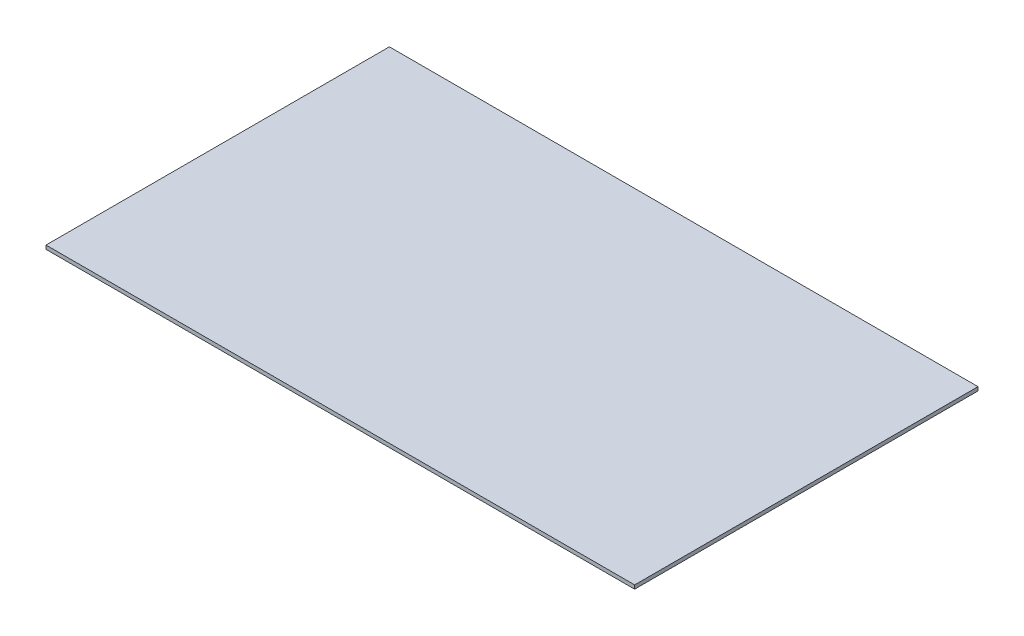
ISO-10303-21;
HEADER;
FILE_DESCRIPTION(('STEP AP214'),'2;1');
FILE_NAME('part.step','',(''),(''),'','','');
FILE_SCHEMA(('AUTOMOTIVE_DESIGN { 1 0 10303 214 1 1 1 1 }'));
ENDSEC;
DATA;
#1=APPLICATION_CONTEXT('core data for automotive mechanical design processes');
#2=APPLICATION_PROTOCOL_DEFINITION('international standard','automotive_design',2000,#1);
#3=PRODUCT_CONTEXT('',#1,'mechanical');
#4=PRODUCT('Part','Part','',(#3));
#5=PRODUCT_RELATED_PRODUCT_CATEGORY('part','',(#4));
#6=PRODUCT_DEFINITION_FORMATION('','',#4);
#7=PRODUCT_DEFINITION_CONTEXT('part definition',#1,'design');
#8=PRODUCT_DEFINITION('design','',#6,#7);
#9=PRODUCT_DEFINITION_SHAPE('','',#8);
#10=(LENGTH_UNIT() NAMED_UNIT(*) SI_UNIT(.MILLI.,.METRE.));
#11=(NAMED_UNIT(*) PLANE_ANGLE_UNIT() SI_UNIT($,.RADIAN.));
#12=(NAMED_UNIT(*) SI_UNIT($,.STERADIAN.) SOLID_ANGLE_UNIT());
#13=UNCERTAINTY_MEASURE_WITH_UNIT(LENGTH_MEASURE(1.E-05),#10,'distance_accuracy_value','');
#14=(GEOMETRIC_REPRESENTATION_CONTEXT(3) GLOBAL_UNCERTAINTY_ASSIGNED_CONTEXT((#13)) GLOBAL_UNIT_ASSIGNED_CONTEXT((#10,
#11,#12)) REPRESENTATION_CONTEXT('',''));
#15=CARTESIAN_POINT('',(0.,0.,0.));
#16=DIRECTION('',(0.,0.,1.));
#17=DIRECTION('',(1.,0.,0.));
#18=AXIS2_PLACEMENT_3D('',#15,#16,#17);
#19=CARTESIAN_POINT('',(0.,0.381,0.));
#20=DIRECTION('',(1.,0.,0.));
#21=DIRECTION('',(0.,0.,-1.));
#22=AXIS2_PLACEMENT_3D('',#19,#20,#21);
#23=PLANE('',#22);
#24=DIRECTION('',(0.,0.,1.));
#25=VECTOR('',#24,1.);
#26=CARTESIAN_POINT('',(0.,0.,0.));
#27=LINE('',#26,#25);
#28=CARTESIAN_POINT('',(0.,0.,-35.));
#29=VERTEX_POINT('',#28);
#30=CARTESIAN_POINT('',(0.,0.,0.));
#31=VERTEX_POINT('',#30);
#32=EDGE_CURVE('E111',#29,#31,#27,.T.);
#33=ORIENTED_EDGE('',*,*,#32,.T.);
#34=DIRECTION('',(0.,-1.,0.));
#35=VECTOR('',#34,1.);
#36=CARTESIAN_POINT('',(0.,0.381,0.));
#37=LINE('',#36,#35);
#38=CARTESIAN_POINT('',(0.,0.381,0.));
#39=VERTEX_POINT('',#38);
#40=EDGE_CURVE('E11',#39,#31,#37,.T.);
#41=ORIENTED_EDGE('',*,*,#40,.F.);
#42=DIRECTION('',(0.,0.,1.));
#43=VECTOR('',#42,1.);
#44=CARTESIAN_POINT('',(0.,0.381,0.));
#45=LINE('',#44,#43);
#46=CARTESIAN_POINT('',(0.,0.381,-35.));
#47=VERTEX_POINT('',#46);
#48=EDGE_CURVE('E95',#47,#39,#45,.T.);
#49=ORIENTED_EDGE('',*,*,#48,.F.);
#50=DIRECTION('',(0.,-1.,0.));
#51=VECTOR('',#50,1.);
#52=CARTESIAN_POINT('',(0.,0.381,-35.));
#53=LINE('',#52,#51);
#54=EDGE_CURVE('E107',#47,#29,#53,.T.);
#55=ORIENTED_EDGE('',*,*,#54,.T.);
#56=EDGE_LOOP('',(#33,#41,#49,#55));
#57=FACE_BOUND('',#56,.T.);
#58=ADVANCED_FACE('F43',(#57),#23,.F.);
#59=CARTESIAN_POINT('',(0.,0.381,0.));
#60=DIRECTION('',(0.,0.,-1.));
#61=DIRECTION('',(-1.,0.,0.));
#62=AXIS2_PLACEMENT_3D('',#59,#60,#61);
#63=PLANE('',#62);
#64=DIRECTION('',(1.,0.,0.));
#65=VECTOR('',#64,1.);
#66=CARTESIAN_POINT('',(0.,0.,0.));
#67=LINE('',#66,#65);
#68=CARTESIAN_POINT('',(60.,0.,0.));
#69=VERTEX_POINT('',#68);
#70=EDGE_CURVE('E100',#31,#69,#67,.T.);
#71=ORIENTED_EDGE('',*,*,#70,.T.);
#72=DIRECTION('',(0.,-1.,0.));
#73=VECTOR('',#72,1.);
#74=CARTESIAN_POINT('',(60.,0.381,0.));
#75=LINE('',#74,#73);
#76=CARTESIAN_POINT('',(60.,0.381,0.));
#77=VERTEX_POINT('',#76);
#78=EDGE_CURVE('E52',#77,#69,#75,.T.);
#79=ORIENTED_EDGE('',*,*,#78,.F.);
#80=DIRECTION('',(1.,0.,0.));
#81=VECTOR('',#80,1.);
#82=CARTESIAN_POINT('',(0.,0.381,0.));
#83=LINE('',#82,#81);
#84=EDGE_CURVE('E90',#39,#77,#83,.T.);
#85=ORIENTED_EDGE('',*,*,#84,.F.);
#86=ORIENTED_EDGE('',*,*,#40,.T.);
#87=EDGE_LOOP('',(#71,#79,#85,#86));
#88=FACE_BOUND('',#87,.T.);
#89=ADVANCED_FACE('F99',(#88),#63,.F.);
#90=CARTESIAN_POINT('',(60.,0.381,0.));
#91=DIRECTION('',(-1.,0.,0.));
#92=DIRECTION('',(0.,0.,1.));
#93=AXIS2_PLACEMENT_3D('',#90,#91,#92);
#94=PLANE('',#93);
#95=DIRECTION('',(0.,0.,-1.));
#96=VECTOR('',#95,1.);
#97=CARTESIAN_POINT('',(60.,0.,0.));
#98=LINE('',#97,#96);
#99=CARTESIAN_POINT('',(60.,0.,-35.));
#100=VERTEX_POINT('',#99);
#101=EDGE_CURVE('E77',#69,#100,#98,.T.);
#102=ORIENTED_EDGE('',*,*,#101,.T.);
#103=DIRECTION('',(0.,-1.,0.));
#104=VECTOR('',#103,1.);
#105=CARTESIAN_POINT('',(60.,0.381,-35.));
#106=LINE('',#105,#104);
#107=CARTESIAN_POINT('',(60.,0.381,-35.));
#108=VERTEX_POINT('',#107);
#109=EDGE_CURVE('E102',#108,#100,#106,.T.);
#110=ORIENTED_EDGE('',*,*,#109,.F.);
#111=DIRECTION('',(0.,0.,-1.));
#112=VECTOR('',#111,1.);
#113=CARTESIAN_POINT('',(60.,0.381,0.));
#114=LINE('',#113,#112);
#115=EDGE_CURVE('E93',#77,#108,#114,.T.);
#116=ORIENTED_EDGE('',*,*,#115,.F.);
#117=ORIENTED_EDGE('',*,*,#78,.T.);
#118=EDGE_LOOP('',(#102,#110,#116,#117));
#119=FACE_BOUND('',#118,.T.);
#120=ADVANCED_FACE('F103',(#119),#94,.F.);
#121=CARTESIAN_POINT('',(0.,0.381,-35.));
#122=DIRECTION('',(0.,0.,1.));
#123=DIRECTION('',(1.,0.,0.));
#124=AXIS2_PLACEMENT_3D('',#121,#122,#123);
#125=PLANE('',#124);
#126=DIRECTION('',(-1.,0.,0.));
#127=VECTOR('',#126,1.);
#128=CARTESIAN_POINT('',(0.,0.,-35.));
#129=LINE('',#128,#127);
#130=EDGE_CURVE('E83',#100,#29,#129,.T.);
#131=ORIENTED_EDGE('',*,*,#130,.T.);
#132=ORIENTED_EDGE('',*,*,#54,.F.);
#133=DIRECTION('',(-1.,0.,0.));
#134=VECTOR('',#133,1.);
#135=CARTESIAN_POINT('',(0.,0.381,-35.));
#136=LINE('',#135,#134);
#137=EDGE_CURVE('E60',#108,#47,#136,.T.);
#138=ORIENTED_EDGE('',*,*,#137,.F.);
#139=ORIENTED_EDGE('',*,*,#109,.T.);
#140=EDGE_LOOP('',(#131,#132,#138,#139));
#141=FACE_BOUND('',#140,.T.);
#142=ADVANCED_FACE('F124',(#141),#125,.F.);
#143=CARTESIAN_POINT('',(0.,0.381,0.));
#144=DIRECTION('',(0.,-1.,0.));
#145=DIRECTION('',(0.,0.,-1.));
#146=AXIS2_PLACEMENT_3D('',#143,#144,#145);
#147=PLANE('',#146);
#148=ORIENTED_EDGE('',*,*,#48,.T.);
#149=ORIENTED_EDGE('',*,*,#84,.T.);
#150=ORIENTED_EDGE('',*,*,#115,.T.);
#151=ORIENTED_EDGE('',*,*,#137,.T.);
#152=EDGE_LOOP('',(#148,#149,#150,#151));
#153=FACE_BOUND('',#152,.T.);
#154=ADVANCED_FACE('F91',(#153),#147,.F.);
#155=CARTESIAN_POINT('',(0.,0.,0.));
#156=DIRECTION('',(0.,-1.,0.));
#157=DIRECTION('',(0.,0.,-1.));
#158=AXIS2_PLACEMENT_3D('',#155,#156,#157);
#159=PLANE('',#158);
#160=ORIENTED_EDGE('',*,*,#32,.F.);
#161=ORIENTED_EDGE('',*,*,#130,.F.);
#162=ORIENTED_EDGE('',*,*,#101,.F.);
#163=ORIENTED_EDGE('',*,*,#70,.F.);
#164=EDGE_LOOP('',(#160,#161,#162,#163));
#165=FACE_BOUND('',#164,.T.);
#166=ADVANCED_FACE('F127',(#165),#159,.T.);
#167=CLOSED_SHELL('',(#58,#89,#120,#142,#154,#166));
#168=MANIFOLD_SOLID_BREP('B2',#167);
#169=ADVANCED_BREP_SHAPE_REPRESENTATION('',(#18,#168),#14);
#170=SHAPE_DEFINITION_REPRESENTATION(#9,#169);
ENDSEC;
END-ISO-10303-21;
